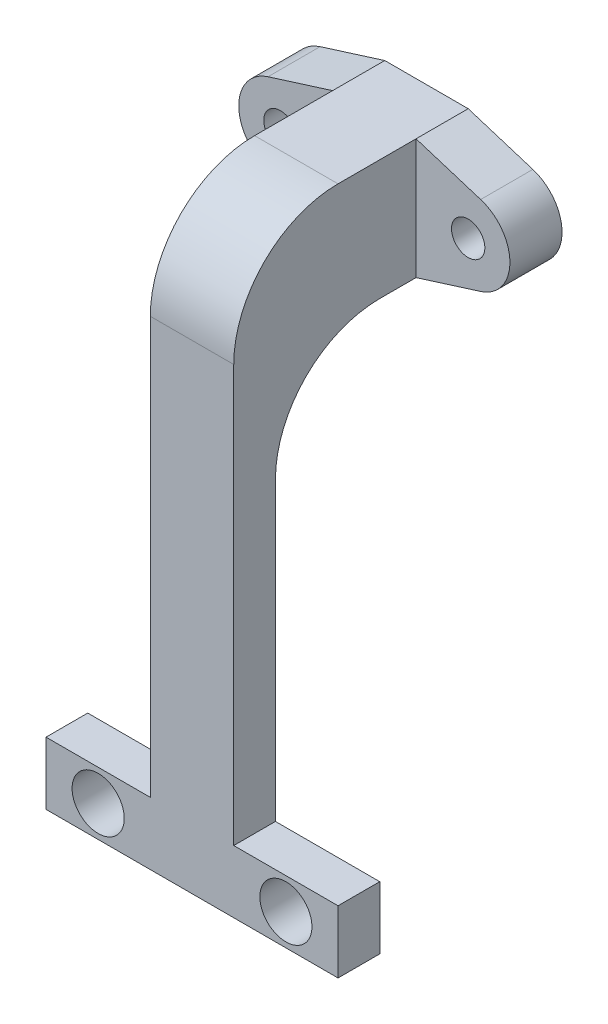
ISO-10303-21;
HEADER;
FILE_DESCRIPTION(('STEP AP214'),'2;1');
FILE_NAME('part.step','',(''),(''),'','','');
FILE_SCHEMA(('AUTOMOTIVE_DESIGN { 1 0 10303 214 1 1 1 1 }'));
ENDSEC;
DATA;
#1=APPLICATION_CONTEXT('core data for automotive mechanical design processes');
#2=APPLICATION_PROTOCOL_DEFINITION('international standard','automotive_design',2000,#1);
#3=PRODUCT_CONTEXT('',#1,'mechanical');
#4=PRODUCT('Part','Part','',(#3));
#5=PRODUCT_RELATED_PRODUCT_CATEGORY('part','',(#4));
#6=PRODUCT_DEFINITION_FORMATION('','',#4);
#7=PRODUCT_DEFINITION_CONTEXT('part definition',#1,'design');
#8=PRODUCT_DEFINITION('design','',#6,#7);
#9=PRODUCT_DEFINITION_SHAPE('','',#8);
#10=(LENGTH_UNIT() NAMED_UNIT(*) SI_UNIT(.MILLI.,.METRE.));
#11=(NAMED_UNIT(*) PLANE_ANGLE_UNIT() SI_UNIT($,.RADIAN.));
#12=(NAMED_UNIT(*) SI_UNIT($,.STERADIAN.) SOLID_ANGLE_UNIT());
#13=UNCERTAINTY_MEASURE_WITH_UNIT(LENGTH_MEASURE(1.E-05),#10,'distance_accuracy_value','');
#14=(GEOMETRIC_REPRESENTATION_CONTEXT(3) GLOBAL_UNCERTAINTY_ASSIGNED_CONTEXT((#13)) GLOBAL_UNIT_ASSIGNED_CONTEXT((#10,
#11,#12)) REPRESENTATION_CONTEXT('',''));
#15=CARTESIAN_POINT('',(0.,0.,0.));
#16=DIRECTION('',(0.,0.,1.));
#17=DIRECTION('',(1.,0.,0.));
#18=AXIS2_PLACEMENT_3D('',#15,#16,#17);
#19=CARTESIAN_POINT('',(4.00000018998981,5.76300080865622,22.480363203067));
#20=DIRECTION('',(-1.,0.,0.));
#21=DIRECTION('',(0.,0.,1.));
#22=AXIS2_PLACEMENT_3D('',#19,#20,#21);
#23=PLANE('',#22);
#24=DIRECTION('',(0.,0.,-1.));
#25=VECTOR('',#24,1.);
#26=CARTESIAN_POINT('',(4.00000018998981,5.76300080865622,22.480363203067));
#27=LINE('',#26,#25);
#28=CARTESIAN_POINT('',(4.00000018998981,5.76300080865622,12.480363203067));
#29=VERTEX_POINT('',#28);
#30=CARTESIAN_POINT('',(4.00000018998981,5.76300080865622,5.));
#31=VERTEX_POINT('',#30);
#32=EDGE_CURVE('E233',#29,#31,#27,.T.);
#33=ORIENTED_EDGE('',*,*,#32,.F.);
#34=CARTESIAN_POINT('',(4.00000018998981,-4.23699919134378,12.480363203067));
#35=DIRECTION('',(-1.,0.,0.));
#36=DIRECTION('',(0.,0.,1.));
#37=AXIS2_PLACEMENT_3D('',#34,#35,#36);
#38=CIRCLE('',#37,10.);
#39=CARTESIAN_POINT('',(4.00000018998981,-4.23699919134378,22.480363203067));
#40=VERTEX_POINT('',#39);
#41=EDGE_CURVE('E11',#29,#40,#38,.F.);
#42=ORIENTED_EDGE('',*,*,#41,.T.);
#43=DIRECTION('',(0.,1.,0.));
#44=VECTOR('',#43,1.);
#45=CARTESIAN_POINT('',(4.00000018998981,5.76300080865622,22.480363203067));
#46=LINE('',#45,#44);
#47=CARTESIAN_POINT('',(4.00000018998981,-44.1838474532043,22.480363203067));
#48=VERTEX_POINT('',#47);
#49=EDGE_CURVE('E218',#48,#40,#46,.T.);
#50=ORIENTED_EDGE('',*,*,#49,.F.);
#51=DIRECTION('',(0.,0.,1.));
#52=VECTOR('',#51,1.);
#53=CARTESIAN_POINT('',(4.00000018998981,-44.1838474532043,22.480363203067));
#54=LINE('',#53,#52);
#55=CARTESIAN_POINT('',(4.00000018998981,-44.1838474532043,18.480363203067));
#56=VERTEX_POINT('',#55);
#57=EDGE_CURVE('E182',#56,#48,#54,.T.);
#58=ORIENTED_EDGE('',*,*,#57,.F.);
#59=DIRECTION('',(0.,1.,0.));
#60=VECTOR('',#59,1.);
#61=CARTESIAN_POINT('',(4.00000018998981,-59.1281197030675,18.480363203067));
#62=LINE('',#61,#60);
#63=CARTESIAN_POINT('',(4.00000018998981,-15.7649998925626,18.480363203067));
#64=VERTEX_POINT('',#63);
#65=EDGE_CURVE('E169',#56,#64,#62,.T.);
#66=ORIENTED_EDGE('',*,*,#65,.T.);
#67=CARTESIAN_POINT('',(4.00000018998981,-15.7649998925626,8.48036320306701));
#68=DIRECTION('',(-1.,0.,0.));
#69=DIRECTION('',(0.,0.,1.));
#70=AXIS2_PLACEMENT_3D('',#67,#68,#69);
#71=CIRCLE('',#70,10.);
#72=CARTESIAN_POINT('',(4.00000018998981,-5.76499989256263,8.48036320306701));
#73=VERTEX_POINT('',#72);
#74=EDGE_CURVE('E308',#64,#73,#71,.T.);
#75=ORIENTED_EDGE('',*,*,#74,.T.);
#76=DIRECTION('',(0.,0.,-1.));
#77=VECTOR('',#76,1.);
#78=CARTESIAN_POINT('',(4.00000018998981,-5.76499989256263,22.480363203067));
#79=LINE('',#78,#77);
#80=CARTESIAN_POINT('',(4.00000018998981,-5.76499989256263,5.));
#81=VERTEX_POINT('',#80);
#82=EDGE_CURVE('E223',#73,#81,#79,.T.);
#83=ORIENTED_EDGE('',*,*,#82,.T.);
#84=DIRECTION('',(0.,1.,0.));
#85=VECTOR('',#84,1.);
#86=CARTESIAN_POINT('',(4.00000018998981,5.76300080865622,5.));
#87=LINE('',#86,#85);
#88=EDGE_CURVE('E212',#81,#31,#87,.T.);
#89=ORIENTED_EDGE('',*,*,#88,.T.);
#90=EDGE_LOOP('',(#33,#42,#50,#58,#66,#75,#83,#89));
#91=FACE_BOUND('',#90,.T.);
#92=ADVANCED_FACE('F33',(#91),#23,.F.);
#93=CARTESIAN_POINT('',(-4.00000018998981,5.76300080865622,22.480363203067));
#94=DIRECTION('',(1.,0.,0.));
#95=DIRECTION('',(0.,0.,-1.));
#96=AXIS2_PLACEMENT_3D('',#93,#94,#95);
#97=PLANE('',#96);
#98=DIRECTION('',(0.,-1.,0.));
#99=VECTOR('',#98,1.);
#100=CARTESIAN_POINT('',(-4.00000018998981,5.76300080865622,22.480363203067));
#101=LINE('',#100,#99);
#102=CARTESIAN_POINT('',(-4.00000018998981,-4.23699919134378,22.480363203067));
#103=VERTEX_POINT('',#102);
#104=CARTESIAN_POINT('',(-4.00000018998981,-44.1831612686769,22.480363203067));
#105=VERTEX_POINT('',#104);
#106=EDGE_CURVE('E220',#103,#105,#101,.T.);
#107=ORIENTED_EDGE('',*,*,#106,.F.);
#108=CARTESIAN_POINT('',(-4.00000018998981,-4.23699919134378,12.480363203067));
#109=DIRECTION('',(1.,0.,0.));
#110=DIRECTION('',(0.,0.,-1.));
#111=AXIS2_PLACEMENT_3D('',#108,#109,#110);
#112=CIRCLE('',#111,10.);
#113=CARTESIAN_POINT('',(-4.00000018998981,5.76300080865622,12.480363203067));
#114=VERTEX_POINT('',#113);
#115=EDGE_CURVE('E55',#103,#114,#112,.F.);
#116=ORIENTED_EDGE('',*,*,#115,.T.);
#117=DIRECTION('',(0.,0.,-1.));
#118=VECTOR('',#117,1.);
#119=CARTESIAN_POINT('',(-4.00000018998981,5.76300080865622,22.480363203067));
#120=LINE('',#119,#118);
#121=CARTESIAN_POINT('',(-4.00000018998981,5.76300080865622,5.));
#122=VERTEX_POINT('',#121);
#123=EDGE_CURVE('E231',#114,#122,#120,.T.);
#124=ORIENTED_EDGE('',*,*,#123,.T.);
#125=DIRECTION('',(0.,-1.,0.));
#126=VECTOR('',#125,1.);
#127=CARTESIAN_POINT('',(-4.00000018998981,5.76300080865622,5.));
#128=LINE('',#127,#126);
#129=CARTESIAN_POINT('',(-4.00000018998981,-5.76499989256263,5.));
#130=VERTEX_POINT('',#129);
#131=EDGE_CURVE('E221',#122,#130,#128,.T.);
#132=ORIENTED_EDGE('',*,*,#131,.T.);
#133=DIRECTION('',(0.,0.,-1.));
#134=VECTOR('',#133,1.);
#135=CARTESIAN_POINT('',(-4.00000018998981,-5.76499989256263,22.480363203067));
#136=LINE('',#135,#134);
#137=CARTESIAN_POINT('',(-4.00000018998981,-5.76499989256263,8.48036320306701));
#138=VERTEX_POINT('',#137);
#139=EDGE_CURVE('E229',#138,#130,#136,.T.);
#140=ORIENTED_EDGE('',*,*,#139,.F.);
#141=CARTESIAN_POINT('',(-4.00000018998981,-15.7649998925626,8.48036320306701));
#142=DIRECTION('',(1.,0.,0.));
#143=DIRECTION('',(0.,0.,-1.));
#144=AXIS2_PLACEMENT_3D('',#141,#142,#143);
#145=CIRCLE('',#144,10.);
#146=CARTESIAN_POINT('',(-4.0000001899898,-15.7649998925626,18.480363203067));
#147=VERTEX_POINT('',#146);
#148=EDGE_CURVE('E310',#138,#147,#145,.T.);
#149=ORIENTED_EDGE('',*,*,#148,.T.);
#150=DIRECTION('',(0.,1.,0.));
#151=VECTOR('',#150,1.);
#152=CARTESIAN_POINT('',(-4.0000001899898,-59.1281197030675,18.480363203067));
#153=LINE('',#152,#151);
#154=CARTESIAN_POINT('',(-4.00000018998981,-44.1831612686769,18.480363203067));
#155=VERTEX_POINT('',#154);
#156=EDGE_CURVE('E211',#155,#147,#153,.T.);
#157=ORIENTED_EDGE('',*,*,#156,.F.);
#158=DIRECTION('',(0.,0.,-1.));
#159=VECTOR('',#158,1.);
#160=CARTESIAN_POINT('',(-4.00000018998981,-44.1831612686769,18.480363203067));
#161=LINE('',#160,#159);
#162=EDGE_CURVE('E195',#105,#155,#161,.T.);
#163=ORIENTED_EDGE('',*,*,#162,.F.);
#164=EDGE_LOOP('',(#107,#116,#124,#132,#140,#149,#157,#163));
#165=FACE_BOUND('',#164,.T.);
#166=ADVANCED_FACE('F320',(#165),#97,.F.);
#167=CARTESIAN_POINT('',(-4.00000018998981,-5.76499989256263,5.));
#168=DIRECTION('',(0.,1.,0.));
#169=DIRECTION('',(0.,0.,1.));
#170=AXIS2_PLACEMENT_3D('',#167,#168,#169);
#171=PLANE('',#170);
#172=ORIENTED_EDGE('',*,*,#82,.F.);
#173=DIRECTION('',(1.,0.,0.));
#174=VECTOR('',#173,1.);
#175=CARTESIAN_POINT('',(-4.00000018998981,-5.76499989256263,8.48036320306701));
#176=LINE('',#175,#174);
#177=EDGE_CURVE('E306',#73,#138,#176,.F.);
#178=ORIENTED_EDGE('',*,*,#177,.T.);
#179=ORIENTED_EDGE('',*,*,#139,.T.);
#180=DIRECTION('',(0.,0.,-1.));
#181=VECTOR('',#180,1.);
#182=CARTESIAN_POINT('',(-4.00000018998981,-5.76499989256263,5.));
#183=LINE('',#182,#181);
#184=CARTESIAN_POINT('',(-4.00000018998981,-5.76499989256263,0.));
#185=VERTEX_POINT('',#184);
#186=EDGE_CURVE('E297',#130,#185,#183,.T.);
#187=ORIENTED_EDGE('',*,*,#186,.T.);
#188=DIRECTION('',(1.,0.,0.));
#189=VECTOR('',#188,1.);
#190=CARTESIAN_POINT('',(-4.00000018998981,-5.76499989256263,0.));
#191=LINE('',#190,#189);
#192=CARTESIAN_POINT('',(4.00000018998981,-5.76499989256263,0.));
#193=VERTEX_POINT('',#192);
#194=EDGE_CURVE('E269',#185,#193,#191,.T.);
#195=ORIENTED_EDGE('',*,*,#194,.T.);
#196=DIRECTION('',(0.,0.,-1.));
#197=VECTOR('',#196,1.);
#198=CARTESIAN_POINT('',(4.00000018998981,-5.76499989256263,5.));
#199=LINE('',#198,#197);
#200=EDGE_CURVE('E294',#81,#193,#199,.T.);
#201=ORIENTED_EDGE('',*,*,#200,.F.);
#202=EDGE_LOOP('',(#172,#178,#179,#187,#195,#201));
#203=FACE_BOUND('',#202,.T.);
#204=ADVANCED_FACE('F348',(#203),#171,.F.);
#205=CARTESIAN_POINT('',(-9.00014511895117,-0.00106902473267904,5.));
#206=DIRECTION('',(0.,0.,1.));
#207=DIRECTION('',(1.,0.,0.));
#208=AXIS2_PLACEMENT_3D('',#205,#206,#207);
#209=PLANE('',#208);
#210=ORIENTED_EDGE('',*,*,#88,.F.);
#211=DIRECTION('',(0.954001475587167,0.299801908895704,0.));
#212=VECTOR('',#211,1.);
#213=CARTESIAN_POINT('',(4.00000018998981,-5.76499989256263,5.));
#214=LINE('',#213,#212);
#215=CARTESIAN_POINT('',(10.1977820003338,-3.81730183840964,5.));
#216=VERTEX_POINT('',#215);
#217=EDGE_CURVE('E255',#81,#216,#214,.T.);
#218=ORIENTED_EDGE('',*,*,#217,.T.);
#219=CARTESIAN_POINT('',(8.99797345167928,0.000616233074978096,5.));
#220=DIRECTION('',(0.,0.,1.));
#221=DIRECTION('',(1.,0.,0.));
#222=AXIS2_PLACEMENT_3D('',#219,#220,#221);
#223=CIRCLE('',#222,4.00200436706325);
#224=CARTESIAN_POINT('',(10.1959695758342,3.81910339954591,5.));
#225=VERTEX_POINT('',#224);
#226=EDGE_CURVE('E257',#216,#225,#223,.T.);
#227=ORIENTED_EDGE('',*,*,#226,.T.);
#228=DIRECTION('',(-0.954143678077247,0.29934902970483,0.));
#229=VECTOR('',#228,1.);
#230=CARTESIAN_POINT('',(10.1959695758342,3.81910339954591,5.));
#231=LINE('',#230,#229);
#232=EDGE_CURVE('E259',#225,#31,#231,.T.);
#233=ORIENTED_EDGE('',*,*,#232,.T.);
#234=EDGE_LOOP('',(#210,#218,#227,#233));
#235=FACE_BOUND('',#234,.T.);
#236=CARTESIAN_POINT('',(8.99797345167928,0.000616233074978096,5.));
#237=DIRECTION('',(0.,0.,1.));
#238=DIRECTION('',(1.,0.,0.));
#239=AXIS2_PLACEMENT_3D('',#236,#237,#238);
#240=CIRCLE('',#239,1.59816028146403);
#241=CARTESIAN_POINT('',(10.5961337331433,0.000616233074978096,5.));
#242=VERTEX_POINT('',#241);
#243=EDGE_CURVE('E242',#242,#242,#240,.T.);
#244=ORIENTED_EDGE('',*,*,#243,.F.);
#245=EDGE_LOOP('',(#244));
#246=FACE_BOUND('',#245,.T.);
#247=ADVANCED_FACE('F365',(#235,#246),#209,.T.);
#248=ORIENTED_EDGE('',*,*,#131,.F.);
#249=DIRECTION('',(-0.954029129539832,-0.299713896890804,0.));
#250=VECTOR('',#249,1.);
#251=CARTESIAN_POINT('',(-4.00000018998981,5.76300080865622,5.));
#252=LINE('',#251,#250);
#253=CARTESIAN_POINT('',(-10.1991438510935,3.8155031416285,5.));
#254=VERTEX_POINT('',#253);
#255=EDGE_CURVE('E262',#122,#254,#252,.T.);
#256=ORIENTED_EDGE('',*,*,#255,.T.);
#257=CARTESIAN_POINT('',(-9.00014511895117,-0.00106902473267904,5.));
#258=DIRECTION('',(0.,0.,1.));
#259=DIRECTION('',(1.,0.,0.));
#260=AXIS2_PLACEMENT_3D('',#257,#258,#259);
#261=CIRCLE('',#260,4.00047760407701);
#262=CARTESIAN_POINT('',(-10.1990659794877,-3.81766565404682,5.));
#263=VERTEX_POINT('',#262);
#264=EDGE_CURVE('E248',#254,#263,#261,.T.);
#265=ORIENTED_EDGE('',*,*,#264,.T.);
#266=DIRECTION('',(0.954035244547933,-0.299694431313572,0.));
#267=VECTOR('',#266,1.);
#268=CARTESIAN_POINT('',(-10.1990659794877,-3.81766565404682,5.));
#269=LINE('',#268,#267);
#270=EDGE_CURVE('E251',#263,#130,#269,.T.);
#271=ORIENTED_EDGE('',*,*,#270,.T.);
#272=EDGE_LOOP('',(#248,#256,#265,#271));
#273=FACE_BOUND('',#272,.T.);
#274=CARTESIAN_POINT('',(-9.00014511895117,-0.00106902473267904,5.));
#275=DIRECTION('',(0.,0.,1.));
#276=DIRECTION('',(1.,0.,0.));
#277=AXIS2_PLACEMENT_3D('',#274,#275,#276);
#278=CIRCLE('',#277,1.60099342901495);
#279=CARTESIAN_POINT('',(-7.39915168993622,-0.00106902473267904,5.));
#280=VERTEX_POINT('',#279);
#281=EDGE_CURVE('E236',#280,#280,#278,.T.);
#282=ORIENTED_EDGE('',*,*,#281,.F.);
#283=EDGE_LOOP('',(#282));
#284=FACE_BOUND('',#283,.T.);
#285=ADVANCED_FACE('F361',(#273,#284),#209,.T.);
#286=CARTESIAN_POINT('',(-9.00014511895117,-0.00106902473267904,0.));
#287=DIRECTION('',(0.,0.,1.));
#288=DIRECTION('',(1.,0.,0.));
#289=AXIS2_PLACEMENT_3D('',#286,#287,#288);
#290=PLANE('',#289);
#291=CARTESIAN_POINT('',(-9.00014511895117,-0.00106902473267904,0.));
#292=DIRECTION('',(0.,0.,1.));
#293=DIRECTION('',(1.,0.,0.));
#294=AXIS2_PLACEMENT_3D('',#291,#292,#293);
#295=CIRCLE('',#294,4.00047760407701);
#296=CARTESIAN_POINT('',(-10.1991438510935,3.8155031416285,0.));
#297=VERTEX_POINT('',#296);
#298=CARTESIAN_POINT('',(-10.1990659794877,-3.81766565404682,0.));
#299=VERTEX_POINT('',#298);
#300=EDGE_CURVE('E245',#297,#299,#295,.T.);
#301=ORIENTED_EDGE('',*,*,#300,.F.);
#302=DIRECTION('',(-0.954029129539832,-0.299713896890804,0.));
#303=VECTOR('',#302,1.);
#304=CARTESIAN_POINT('',(-4.00000018998981,5.76300080865622,0.));
#305=LINE('',#304,#303);
#306=CARTESIAN_POINT('',(-4.00000018998981,5.76300080865622,0.));
#307=VERTEX_POINT('',#306);
#308=EDGE_CURVE('E252',#307,#297,#305,.T.);
#309=ORIENTED_EDGE('',*,*,#308,.F.);
#310=DIRECTION('',(-1.,0.,0.));
#311=VECTOR('',#310,1.);
#312=CARTESIAN_POINT('',(4.00000018998981,5.76300080865622,0.));
#313=LINE('',#312,#311);
#314=CARTESIAN_POINT('',(4.00000018998981,5.76300080865622,0.));
#315=VERTEX_POINT('',#314);
#316=EDGE_CURVE('E277',#315,#307,#313,.T.);
#317=ORIENTED_EDGE('',*,*,#316,.F.);
#318=DIRECTION('',(-0.954143678077247,0.29934902970483,0.));
#319=VECTOR('',#318,1.);
#320=CARTESIAN_POINT('',(10.1959695758342,3.81910339954591,0.));
#321=LINE('',#320,#319);
#322=CARTESIAN_POINT('',(10.1959695758342,3.81910339954591,0.));
#323=VERTEX_POINT('',#322);
#324=EDGE_CURVE('E275',#323,#315,#321,.T.);
#325=ORIENTED_EDGE('',*,*,#324,.F.);
#326=CARTESIAN_POINT('',(8.99797345167928,0.000616233074978096,0.));
#327=DIRECTION('',(0.,0.,1.));
#328=DIRECTION('',(1.,0.,0.));
#329=AXIS2_PLACEMENT_3D('',#326,#327,#328);
#330=CIRCLE('',#329,4.00200436706325);
#331=CARTESIAN_POINT('',(10.1977820003338,-3.81730183840964,0.));
#332=VERTEX_POINT('',#331);
#333=EDGE_CURVE('E273',#332,#323,#330,.T.);
#334=ORIENTED_EDGE('',*,*,#333,.F.);
#335=DIRECTION('',(0.954001475587167,0.299801908895704,0.));
#336=VECTOR('',#335,1.);
#337=CARTESIAN_POINT('',(4.00000018998981,-5.76499989256263,0.));
#338=LINE('',#337,#336);
#339=EDGE_CURVE('E271',#193,#332,#338,.T.);
#340=ORIENTED_EDGE('',*,*,#339,.F.);
#341=ORIENTED_EDGE('',*,*,#194,.F.);
#342=DIRECTION('',(0.954035244547933,-0.299694431313572,0.));
#343=VECTOR('',#342,1.);
#344=CARTESIAN_POINT('',(-10.1990659794877,-3.81766565404682,0.));
#345=LINE('',#344,#343);
#346=EDGE_CURVE('E267',#299,#185,#345,.T.);
#347=ORIENTED_EDGE('',*,*,#346,.F.);
#348=EDGE_LOOP('',(#301,#309,#317,#325,#334,#340,#341,#347));
#349=FACE_BOUND('',#348,.T.);
#350=CARTESIAN_POINT('',(8.99797345167928,0.000616233074978096,0.));
#351=DIRECTION('',(0.,0.,1.));
#352=DIRECTION('',(1.,0.,0.));
#353=AXIS2_PLACEMENT_3D('',#350,#351,#352);
#354=CIRCLE('',#353,1.59816028146403);
#355=CARTESIAN_POINT('',(10.5961337331433,0.000616233074978096,0.));
#356=VERTEX_POINT('',#355);
#357=EDGE_CURVE('E239',#356,#356,#354,.T.);
#358=ORIENTED_EDGE('',*,*,#357,.T.);
#359=EDGE_LOOP('',(#358));
#360=FACE_BOUND('',#359,.T.);
#361=CARTESIAN_POINT('',(-9.00014511895117,-0.00106902473267904,0.));
#362=DIRECTION('',(0.,0.,1.));
#363=DIRECTION('',(1.,0.,0.));
#364=AXIS2_PLACEMENT_3D('',#361,#362,#363);
#365=CIRCLE('',#364,1.60099342901495);
#366=CARTESIAN_POINT('',(-7.39915168993622,-0.00106902473267904,0.));
#367=VERTEX_POINT('',#366);
#368=EDGE_CURVE('E235',#367,#367,#365,.T.);
#369=ORIENTED_EDGE('',*,*,#368,.T.);
#370=EDGE_LOOP('',(#369));
#371=FACE_BOUND('',#370,.T.);
#372=ADVANCED_FACE('F364',(#349,#360,#371),#290,.F.);
#373=CARTESIAN_POINT('',(-9.00014511895117,-0.00106902473267904,5.));
#374=DIRECTION('',(0.,0.,-1.));
#375=DIRECTION('',(-1.,0.,0.));
#376=AXIS2_PLACEMENT_3D('',#373,#374,#375);
#377=CYLINDRICAL_SURFACE('',#376,4.00047760407701);
#378=ORIENTED_EDGE('',*,*,#300,.T.);
#379=DIRECTION('',(0.,0.,-1.));
#380=VECTOR('',#379,1.);
#381=CARTESIAN_POINT('',(-10.1990659794877,-3.81766565404682,5.));
#382=LINE('',#381,#380);
#383=EDGE_CURVE('E300',#263,#299,#382,.T.);
#384=ORIENTED_EDGE('',*,*,#383,.F.);
#385=ORIENTED_EDGE('',*,*,#264,.F.);
#386=DIRECTION('',(0.,0.,-1.));
#387=VECTOR('',#386,1.);
#388=CARTESIAN_POINT('',(-10.1991438510935,3.8155031416285,5.));
#389=LINE('',#388,#387);
#390=EDGE_CURVE('E264',#254,#297,#389,.T.);
#391=ORIENTED_EDGE('',*,*,#390,.T.);
#392=EDGE_LOOP('',(#378,#384,#385,#391));
#393=FACE_BOUND('',#392,.T.);
#394=ADVANCED_FACE('F369',(#393),#377,.T.);
#395=CARTESIAN_POINT('',(-10.1990659794877,-3.81766565404682,5.));
#396=DIRECTION('',(0.299694431313572,0.954035244547933,0.));
#397=DIRECTION('',(-0.954035244547933,0.299694431313572,0.));
#398=AXIS2_PLACEMENT_3D('',#395,#396,#397);
#399=PLANE('',#398);
#400=ORIENTED_EDGE('',*,*,#346,.T.);
#401=ORIENTED_EDGE('',*,*,#186,.F.);
#402=ORIENTED_EDGE('',*,*,#270,.F.);
#403=ORIENTED_EDGE('',*,*,#383,.T.);
#404=EDGE_LOOP('',(#400,#401,#402,#403));
#405=FACE_BOUND('',#404,.T.);
#406=ADVANCED_FACE('F388',(#405),#399,.F.);
#407=CARTESIAN_POINT('',(4.00000018998981,-5.76499989256263,5.));
#408=DIRECTION('',(-0.299801908895704,0.954001475587167,0.));
#409=DIRECTION('',(-0.954001475587167,-0.299801908895704,0.));
#410=AXIS2_PLACEMENT_3D('',#407,#408,#409);
#411=PLANE('',#410);
#412=ORIENTED_EDGE('',*,*,#339,.T.);
#413=DIRECTION('',(0.,0.,-1.));
#414=VECTOR('',#413,1.);
#415=CARTESIAN_POINT('',(10.1977820003338,-3.81730183840964,5.));
#416=LINE('',#415,#414);
#417=EDGE_CURVE('E291',#216,#332,#416,.T.);
#418=ORIENTED_EDGE('',*,*,#417,.F.);
#419=ORIENTED_EDGE('',*,*,#217,.F.);
#420=ORIENTED_EDGE('',*,*,#200,.T.);
#421=EDGE_LOOP('',(#412,#418,#419,#420));
#422=FACE_BOUND('',#421,.T.);
#423=ADVANCED_FACE('F384',(#422),#411,.F.);
#424=CARTESIAN_POINT('',(8.99797345167928,0.000616233074978096,5.));
#425=DIRECTION('',(0.,0.,-1.));
#426=DIRECTION('',(-1.,0.,0.));
#427=AXIS2_PLACEMENT_3D('',#424,#425,#426);
#428=CYLINDRICAL_SURFACE('',#427,4.00200436706325);
#429=ORIENTED_EDGE('',*,*,#333,.T.);
#430=DIRECTION('',(0.,0.,-1.));
#431=VECTOR('',#430,1.);
#432=CARTESIAN_POINT('',(10.1959695758342,3.81910339954591,5.));
#433=LINE('',#432,#431);
#434=EDGE_CURVE('E288',#225,#323,#433,.T.);
#435=ORIENTED_EDGE('',*,*,#434,.F.);
#436=ORIENTED_EDGE('',*,*,#226,.F.);
#437=ORIENTED_EDGE('',*,*,#417,.T.);
#438=EDGE_LOOP('',(#429,#435,#436,#437));
#439=FACE_BOUND('',#438,.T.);
#440=ADVANCED_FACE('F380',(#439),#428,.T.);
#441=CARTESIAN_POINT('',(10.1959695758342,3.81910339954591,5.));
#442=DIRECTION('',(-0.29934902970483,-0.954143678077247,0.));
#443=DIRECTION('',(0.954143678077247,-0.29934902970483,0.));
#444=AXIS2_PLACEMENT_3D('',#441,#442,#443);
#445=PLANE('',#444);
#446=ORIENTED_EDGE('',*,*,#324,.T.);
#447=DIRECTION('',(0.,0.,-1.));
#448=VECTOR('',#447,1.);
#449=CARTESIAN_POINT('',(4.00000018998981,5.76300080865622,5.));
#450=LINE('',#449,#448);
#451=EDGE_CURVE('E285',#31,#315,#450,.T.);
#452=ORIENTED_EDGE('',*,*,#451,.F.);
#453=ORIENTED_EDGE('',*,*,#232,.F.);
#454=ORIENTED_EDGE('',*,*,#434,.T.);
#455=EDGE_LOOP('',(#446,#452,#453,#454));
#456=FACE_BOUND('',#455,.T.);
#457=ADVANCED_FACE('F377',(#456),#445,.F.);
#458=CARTESIAN_POINT('',(4.00000018998981,5.76300080865622,5.));
#459=DIRECTION('',(0.,-1.,0.));
#460=DIRECTION('',(0.,0.,-1.));
#461=AXIS2_PLACEMENT_3D('',#458,#459,#460);
#462=PLANE('',#461);
#463=ORIENTED_EDGE('',*,*,#123,.F.);
#464=DIRECTION('',(-1.,0.,0.));
#465=VECTOR('',#464,1.);
#466=CARTESIAN_POINT('',(4.00000018998981,5.76300080865622,12.480363203067));
#467=LINE('',#466,#465);
#468=EDGE_CURVE('E41',#114,#29,#467,.F.);
#469=ORIENTED_EDGE('',*,*,#468,.T.);
#470=ORIENTED_EDGE('',*,*,#32,.T.);
#471=ORIENTED_EDGE('',*,*,#451,.T.);
#472=ORIENTED_EDGE('',*,*,#316,.T.);
#473=DIRECTION('',(0.,0.,-1.));
#474=VECTOR('',#473,1.);
#475=CARTESIAN_POINT('',(-4.00000018998981,5.76300080865622,5.));
#476=LINE('',#475,#474);
#477=EDGE_CURVE('E282',#122,#307,#476,.T.);
#478=ORIENTED_EDGE('',*,*,#477,.F.);
#479=EDGE_LOOP('',(#463,#469,#470,#471,#472,#478));
#480=FACE_BOUND('',#479,.T.);
#481=ADVANCED_FACE('F373',(#480),#462,.F.);
#482=CARTESIAN_POINT('',(-4.00000018998981,5.76300080865622,5.));
#483=DIRECTION('',(0.299713896890804,-0.954029129539832,0.));
#484=DIRECTION('',(0.954029129539832,0.299713896890804,0.));
#485=AXIS2_PLACEMENT_3D('',#482,#483,#484);
#486=PLANE('',#485);
#487=ORIENTED_EDGE('',*,*,#308,.T.);
#488=ORIENTED_EDGE('',*,*,#390,.F.);
#489=ORIENTED_EDGE('',*,*,#255,.F.);
#490=ORIENTED_EDGE('',*,*,#477,.T.);
#491=EDGE_LOOP('',(#487,#488,#489,#490));
#492=FACE_BOUND('',#491,.T.);
#493=ADVANCED_FACE('F359',(#492),#486,.F.);
#494=CARTESIAN_POINT('',(8.99797345167928,0.000616233074978096,5.));
#495=DIRECTION('',(0.,0.,-1.));
#496=DIRECTION('',(-1.,0.,0.));
#497=AXIS2_PLACEMENT_3D('',#494,#495,#496);
#498=CYLINDRICAL_SURFACE('',#497,1.59816028146403);
#499=ORIENTED_EDGE('',*,*,#243,.T.);
#500=EDGE_LOOP('',(#499));
#501=FACE_BOUND('',#500,.T.);
#502=ORIENTED_EDGE('',*,*,#357,.F.);
#503=EDGE_LOOP('',(#502));
#504=FACE_BOUND('',#503,.T.);
#505=ADVANCED_FACE('F355',(#501,#504),#498,.F.);
#506=CARTESIAN_POINT('',(-9.00014511895117,-0.00106902473267904,5.));
#507=DIRECTION('',(0.,0.,-1.));
#508=DIRECTION('',(-1.,0.,0.));
#509=AXIS2_PLACEMENT_3D('',#506,#507,#508);
#510=CYLINDRICAL_SURFACE('',#509,1.60099342901495);
#511=ORIENTED_EDGE('',*,*,#281,.T.);
#512=EDGE_LOOP('',(#511));
#513=FACE_BOUND('',#512,.T.);
#514=ORIENTED_EDGE('',*,*,#368,.F.);
#515=EDGE_LOOP('',(#514));
#516=FACE_BOUND('',#515,.T.);
#517=ADVANCED_FACE('F352',(#513,#516),#510,.F.);
#518=CARTESIAN_POINT('',(0.,0.,22.480363203067));
#519=DIRECTION('',(0.,0.,-1.));
#520=DIRECTION('',(-1.,0.,0.));
#521=AXIS2_PLACEMENT_3D('',#518,#519,#520);
#522=PLANE('',#521);
#523=CARTESIAN_POINT('',(9.00000018998981,-47.1837861867294,22.480363203067));
#524=DIRECTION('',(0.,0.,-1.));
#525=DIRECTION('',(-1.,0.,0.));
#526=AXIS2_PLACEMENT_3D('',#523,#524,#525);
#527=CIRCLE('',#526,2.5);
#528=CARTESIAN_POINT('',(6.50000018998981,-47.1837861867294,22.480363203067));
#529=VERTEX_POINT('',#528);
#530=EDGE_CURVE('E184',#529,#529,#527,.T.);
#531=ORIENTED_EDGE('',*,*,#530,.T.);
#532=EDGE_LOOP('',(#531));
#533=FACE_BOUND('',#532,.T.);
#534=CARTESIAN_POINT('',(-9.00000019036516,-47.1835656274154,22.480363203067));
#535=DIRECTION('',(0.,0.,-1.));
#536=DIRECTION('',(-1.,0.,0.));
#537=AXIS2_PLACEMENT_3D('',#534,#535,#536);
#538=CIRCLE('',#537,2.5);
#539=CARTESIAN_POINT('',(-11.5000001903652,-47.1835656274154,22.480363203067));
#540=VERTEX_POINT('',#539);
#541=EDGE_CURVE('E598',#540,#540,#538,.T.);
#542=ORIENTED_EDGE('',*,*,#541,.T.);
#543=EDGE_LOOP('',(#542));
#544=FACE_BOUND('',#543,.T.);
#545=ORIENTED_EDGE('',*,*,#49,.T.);
#546=DIRECTION('',(-1.,0.,0.));
#547=VECTOR('',#546,1.);
#548=CARTESIAN_POINT('',(0.,-4.23699919134378,22.480363203067));
#549=LINE('',#548,#547);
#550=EDGE_CURVE('E312',#40,#103,#549,.T.);
#551=ORIENTED_EDGE('',*,*,#550,.T.);
#552=ORIENTED_EDGE('',*,*,#106,.T.);
#553=DIRECTION('',(1.,0.,0.));
#554=VECTOR('',#553,1.);
#555=CARTESIAN_POINT('',(-14.0000001899898,-44.1831612686769,22.480363203067));
#556=LINE('',#555,#554);
#557=CARTESIAN_POINT('',(-14.0000001899898,-44.1831612686769,22.480363203067));
#558=VERTEX_POINT('',#557);
#559=EDGE_CURVE('E208',#558,#105,#556,.T.);
#560=ORIENTED_EDGE('',*,*,#559,.F.);
#561=DIRECTION('',(0.,1.,0.));
#562=VECTOR('',#561,1.);
#563=CARTESIAN_POINT('',(-14.0000001899898,-50.1838474532043,22.480363203067));
#564=LINE('',#563,#562);
#565=CARTESIAN_POINT('',(-14.0000001899898,-50.1838474532043,22.480363203067));
#566=VERTEX_POINT('',#565);
#567=EDGE_CURVE('E164',#566,#558,#564,.T.);
#568=ORIENTED_EDGE('',*,*,#567,.F.);
#569=DIRECTION('',(-1.,0.,0.));
#570=VECTOR('',#569,1.);
#571=CARTESIAN_POINT('',(-4.0000001899898,-50.1838474532043,22.480363203067));
#572=LINE('',#571,#570);
#573=CARTESIAN_POINT('',(14.0000001899898,-50.1838474532043,22.480363203067));
#574=VERTEX_POINT('',#573);
#575=EDGE_CURVE('E156',#574,#566,#572,.T.);
#576=ORIENTED_EDGE('',*,*,#575,.F.);
#577=DIRECTION('',(0.,-1.,0.));
#578=VECTOR('',#577,1.);
#579=CARTESIAN_POINT('',(14.0000001899898,-50.1838474532043,22.480363203067));
#580=LINE('',#579,#578);
#581=CARTESIAN_POINT('',(14.0000001899898,-44.1838474532043,22.480363203067));
#582=VERTEX_POINT('',#581);
#583=EDGE_CURVE('E162',#582,#574,#580,.T.);
#584=ORIENTED_EDGE('',*,*,#583,.F.);
#585=DIRECTION('',(-1.,0.,0.));
#586=VECTOR('',#585,1.);
#587=CARTESIAN_POINT('',(14.0000001899898,-44.1838474532043,22.480363203067));
#588=LINE('',#587,#586);
#589=EDGE_CURVE('E190',#582,#48,#588,.T.);
#590=ORIENTED_EDGE('',*,*,#589,.T.);
#591=EDGE_LOOP('',(#545,#551,#552,#560,#568,#576,#584,#590));
#592=FACE_BOUND('',#591,.T.);
#593=ADVANCED_FACE('F159',(#533,#544,#592),#522,.F.);
#594=CARTESIAN_POINT('',(-4.0000001899898,-59.1281197030675,18.480363203067));
#595=DIRECTION('',(0.,0.,1.));
#596=DIRECTION('',(1.,0.,0.));
#597=AXIS2_PLACEMENT_3D('',#594,#595,#596);
#598=PLANE('',#597);
#599=CARTESIAN_POINT('',(9.00000018998981,-47.1837861867294,18.480363203067));
#600=DIRECTION('',(0.,0.,-1.));
#601=DIRECTION('',(-1.,0.,0.));
#602=AXIS2_PLACEMENT_3D('',#599,#600,#601);
#603=CIRCLE('',#602,2.5);
#604=CARTESIAN_POINT('',(6.50000018998981,-47.1837861867294,18.480363203067));
#605=VERTEX_POINT('',#604);
#606=EDGE_CURVE('E595',#605,#605,#603,.T.);
#607=ORIENTED_EDGE('',*,*,#606,.F.);
#608=EDGE_LOOP('',(#607));
#609=FACE_BOUND('',#608,.T.);
#610=CARTESIAN_POINT('',(-9.00000019036516,-47.1835656274154,18.480363203067));
#611=DIRECTION('',(0.,0.,-1.));
#612=DIRECTION('',(-1.,0.,0.));
#613=AXIS2_PLACEMENT_3D('',#610,#611,#612);
#614=CIRCLE('',#613,2.5);
#615=CARTESIAN_POINT('',(-11.5000001903652,-47.1835656274154,18.480363203067));
#616=VERTEX_POINT('',#615);
#617=EDGE_CURVE('E602',#616,#616,#614,.T.);
#618=ORIENTED_EDGE('',*,*,#617,.F.);
#619=EDGE_LOOP('',(#618));
#620=FACE_BOUND('',#619,.T.);
#621=ORIENTED_EDGE('',*,*,#156,.T.);
#622=DIRECTION('',(1.,0.,0.));
#623=VECTOR('',#622,1.);
#624=CARTESIAN_POINT('',(4.00000018998981,-15.7649998925626,18.480363203067));
#625=LINE('',#624,#623);
#626=EDGE_CURVE('E303',#147,#64,#625,.T.);
#627=ORIENTED_EDGE('',*,*,#626,.T.);
#628=ORIENTED_EDGE('',*,*,#65,.F.);
#629=DIRECTION('',(-1.,0.,0.));
#630=VECTOR('',#629,1.);
#631=CARTESIAN_POINT('',(14.0000001899898,-44.1838474532043,18.480363203067));
#632=LINE('',#631,#630);
#633=CARTESIAN_POINT('',(14.0000001899898,-44.1838474532043,18.480363203067));
#634=VERTEX_POINT('',#633);
#635=EDGE_CURVE('E193',#634,#56,#632,.T.);
#636=ORIENTED_EDGE('',*,*,#635,.F.);
#637=DIRECTION('',(0.,1.,0.));
#638=VECTOR('',#637,1.);
#639=CARTESIAN_POINT('',(14.0000001899898,-50.1838474532043,18.480363203067));
#640=LINE('',#639,#638);
#641=CARTESIAN_POINT('',(14.0000001899898,-50.1838474532043,18.480363203067));
#642=VERTEX_POINT('',#641);
#643=EDGE_CURVE('E176',#642,#634,#640,.T.);
#644=ORIENTED_EDGE('',*,*,#643,.F.);
#645=DIRECTION('',(1.,0.,0.));
#646=VECTOR('',#645,1.);
#647=CARTESIAN_POINT('',(-4.0000001899898,-50.1838474532043,18.480363203067));
#648=LINE('',#647,#646);
#649=CARTESIAN_POINT('',(-14.0000001899898,-50.1838474532043,18.480363203067));
#650=VERTEX_POINT('',#649);
#651=EDGE_CURVE('E168',#650,#642,#648,.T.);
#652=ORIENTED_EDGE('',*,*,#651,.F.);
#653=DIRECTION('',(0.,-1.,0.));
#654=VECTOR('',#653,1.);
#655=CARTESIAN_POINT('',(-14.0000001899898,-50.1838474532043,18.480363203067));
#656=LINE('',#655,#654);
#657=CARTESIAN_POINT('',(-14.0000001899898,-44.1831612686769,18.480363203067));
#658=VERTEX_POINT('',#657);
#659=EDGE_CURVE('E196',#658,#650,#656,.T.);
#660=ORIENTED_EDGE('',*,*,#659,.F.);
#661=DIRECTION('',(1.,0.,0.));
#662=VECTOR('',#661,1.);
#663=CARTESIAN_POINT('',(-14.0000001899898,-44.1831612686769,18.480363203067));
#664=LINE('',#663,#662);
#665=EDGE_CURVE('E204',#658,#155,#664,.T.);
#666=ORIENTED_EDGE('',*,*,#665,.T.);
#667=EDGE_LOOP('',(#621,#627,#628,#636,#644,#652,#660,#666));
#668=FACE_BOUND('',#667,.T.);
#669=ADVANCED_FACE('F328',(#609,#620,#668),#598,.F.);
#670=CARTESIAN_POINT('',(12.9999999999997,-50.1838474532043,13.480363203067));
#671=DIRECTION('',(0.,-1.,0.));
#672=DIRECTION('',(-1.,0.,0.));
#673=AXIS2_PLACEMENT_3D('',#670,#671,#672);
#674=PLANE('',#673);
#675=ORIENTED_EDGE('',*,*,#575,.T.);
#676=DIRECTION('',(0.,0.,1.));
#677=VECTOR('',#676,1.);
#678=CARTESIAN_POINT('',(-14.0000001899898,-50.1838474532043,18.480363203067));
#679=LINE('',#678,#677);
#680=EDGE_CURVE('E199',#650,#566,#679,.T.);
#681=ORIENTED_EDGE('',*,*,#680,.F.);
#682=ORIENTED_EDGE('',*,*,#651,.T.);
#683=DIRECTION('',(0.,0.,-1.));
#684=VECTOR('',#683,1.);
#685=CARTESIAN_POINT('',(14.0000001899898,-50.1838474532043,22.480363203067));
#686=LINE('',#685,#684);
#687=EDGE_CURVE('E172',#574,#642,#686,.T.);
#688=ORIENTED_EDGE('',*,*,#687,.F.);
#689=EDGE_LOOP('',(#675,#681,#682,#688));
#690=FACE_BOUND('',#689,.T.);
#691=ADVANCED_FACE('F173',(#690),#674,.T.);
#692=CARTESIAN_POINT('',(-14.0000001899898,-44.1831612686769,18.480363203067));
#693=DIRECTION('',(0.,-1.,0.));
#694=DIRECTION('',(0.,0.,-1.));
#695=AXIS2_PLACEMENT_3D('',#692,#693,#694);
#696=PLANE('',#695);
#697=ORIENTED_EDGE('',*,*,#162,.T.);
#698=ORIENTED_EDGE('',*,*,#665,.F.);
#699=DIRECTION('',(0.,0.,-1.));
#700=VECTOR('',#699,1.);
#701=CARTESIAN_POINT('',(-14.0000001899898,-44.1831612686769,18.480363203067));
#702=LINE('',#701,#700);
#703=EDGE_CURVE('E202',#558,#658,#702,.T.);
#704=ORIENTED_EDGE('',*,*,#703,.F.);
#705=ORIENTED_EDGE('',*,*,#559,.T.);
#706=EDGE_LOOP('',(#697,#698,#704,#705));
#707=FACE_BOUND('',#706,.T.);
#708=ADVANCED_FACE('F324',(#707),#696,.F.);
#709=CARTESIAN_POINT('',(-14.0000001899898,0.,0.));
#710=DIRECTION('',(1.,0.,0.));
#711=DIRECTION('',(0.,0.,-1.));
#712=AXIS2_PLACEMENT_3D('',#709,#710,#711);
#713=PLANE('',#712);
#714=ORIENTED_EDGE('',*,*,#659,.T.);
#715=ORIENTED_EDGE('',*,*,#680,.T.);
#716=ORIENTED_EDGE('',*,*,#567,.T.);
#717=ORIENTED_EDGE('',*,*,#703,.T.);
#718=EDGE_LOOP('',(#714,#715,#716,#717));
#719=FACE_BOUND('',#718,.T.);
#720=ADVANCED_FACE('F331',(#719),#713,.F.);
#721=CARTESIAN_POINT('',(14.0000001899898,-44.1838474532043,22.480363203067));
#722=DIRECTION('',(0.,-1.,0.));
#723=DIRECTION('',(0.,0.,-1.));
#724=AXIS2_PLACEMENT_3D('',#721,#722,#723);
#725=PLANE('',#724);
#726=ORIENTED_EDGE('',*,*,#57,.T.);
#727=ORIENTED_EDGE('',*,*,#589,.F.);
#728=DIRECTION('',(0.,0.,1.));
#729=VECTOR('',#728,1.);
#730=CARTESIAN_POINT('',(14.0000001899898,-44.1838474532043,22.480363203067));
#731=LINE('',#730,#729);
#732=EDGE_CURVE('E180',#634,#582,#731,.T.);
#733=ORIENTED_EDGE('',*,*,#732,.F.);
#734=ORIENTED_EDGE('',*,*,#635,.T.);
#735=EDGE_LOOP('',(#726,#727,#733,#734));
#736=FACE_BOUND('',#735,.T.);
#737=ADVANCED_FACE('F333',(#736),#725,.F.);
#738=CARTESIAN_POINT('',(14.0000001899898,0.,0.));
#739=DIRECTION('',(-1.,0.,0.));
#740=DIRECTION('',(0.,0.,1.));
#741=AXIS2_PLACEMENT_3D('',#738,#739,#740);
#742=PLANE('',#741);
#743=ORIENTED_EDGE('',*,*,#583,.T.);
#744=ORIENTED_EDGE('',*,*,#687,.T.);
#745=ORIENTED_EDGE('',*,*,#643,.T.);
#746=ORIENTED_EDGE('',*,*,#732,.T.);
#747=EDGE_LOOP('',(#743,#744,#745,#746));
#748=FACE_BOUND('',#747,.T.);
#749=ADVANCED_FACE('F178',(#748),#742,.F.);
#750=CARTESIAN_POINT('',(-4.0000001899898,-15.7649998925626,8.48036320306701));
#751=DIRECTION('',(-1.,0.,0.));
#752=DIRECTION('',(0.,0.,1.));
#753=AXIS2_PLACEMENT_3D('',#750,#751,#752);
#754=CYLINDRICAL_SURFACE('',#753,10.);
#755=ORIENTED_EDGE('',*,*,#148,.F.);
#756=ORIENTED_EDGE('',*,*,#177,.F.);
#757=ORIENTED_EDGE('',*,*,#74,.F.);
#758=ORIENTED_EDGE('',*,*,#626,.F.);
#759=EDGE_LOOP('',(#755,#756,#757,#758));
#760=FACE_BOUND('',#759,.T.);
#761=ADVANCED_FACE('F398',(#760),#754,.F.);
#762=CARTESIAN_POINT('',(0.,-4.23699919134378,12.480363203067));
#763=DIRECTION('',(-1.,0.,0.));
#764=DIRECTION('',(0.,0.,1.));
#765=AXIS2_PLACEMENT_3D('',#762,#763,#764);
#766=CYLINDRICAL_SURFACE('',#765,10.);
#767=ORIENTED_EDGE('',*,*,#41,.F.);
#768=ORIENTED_EDGE('',*,*,#468,.F.);
#769=ORIENTED_EDGE('',*,*,#115,.F.);
#770=ORIENTED_EDGE('',*,*,#550,.F.);
#771=EDGE_LOOP('',(#767,#768,#769,#770));
#772=FACE_BOUND('',#771,.T.);
#773=ADVANCED_FACE('F35',(#772),#766,.T.);
#774=CARTESIAN_POINT('',(-9.00000019036516,-47.1835656274154,28.480363203067));
#775=DIRECTION('',(0.,0.,-1.));
#776=DIRECTION('',(-1.,0.,0.));
#777=AXIS2_PLACEMENT_3D('',#774,#775,#776);
#778=CYLINDRICAL_SURFACE('',#777,2.5);
#779=ORIENTED_EDGE('',*,*,#617,.T.);
#780=EDGE_LOOP('',(#779));
#781=FACE_BOUND('',#780,.T.);
#782=ORIENTED_EDGE('',*,*,#541,.F.);
#783=EDGE_LOOP('',(#782));
#784=FACE_BOUND('',#783,.T.);
#785=ADVANCED_FACE('F405',(#781,#784),#778,.F.);
#786=CARTESIAN_POINT('',(9.00000018998981,-47.1837861867294,28.480363203067));
#787=DIRECTION('',(0.,0.,-1.));
#788=DIRECTION('',(-1.,0.,0.));
#789=AXIS2_PLACEMENT_3D('',#786,#787,#788);
#790=CYLINDRICAL_SURFACE('',#789,2.5);
#791=ORIENTED_EDGE('',*,*,#606,.T.);
#792=EDGE_LOOP('',(#791));
#793=FACE_BOUND('',#792,.T.);
#794=ORIENTED_EDGE('',*,*,#530,.F.);
#795=EDGE_LOOP('',(#794));
#796=FACE_BOUND('',#795,.T.);
#797=ADVANCED_FACE('F578',(#793,#796),#790,.F.);
#798=CLOSED_SHELL('',(#92,#166,#204,#247,#285,#372,#394,#406,#423,#440,#457,#481,#493,#505,#517,
#593,#669,#691,#708,#720,#737,#749,#761,#773,#785,#797));
#799=MANIFOLD_SOLID_BREP('B2',#798);
#800=ADVANCED_BREP_SHAPE_REPRESENTATION('',(#18,#799),#14);
#801=SHAPE_DEFINITION_REPRESENTATION(#9,#800);
ENDSEC;
END-ISO-10303-21;
